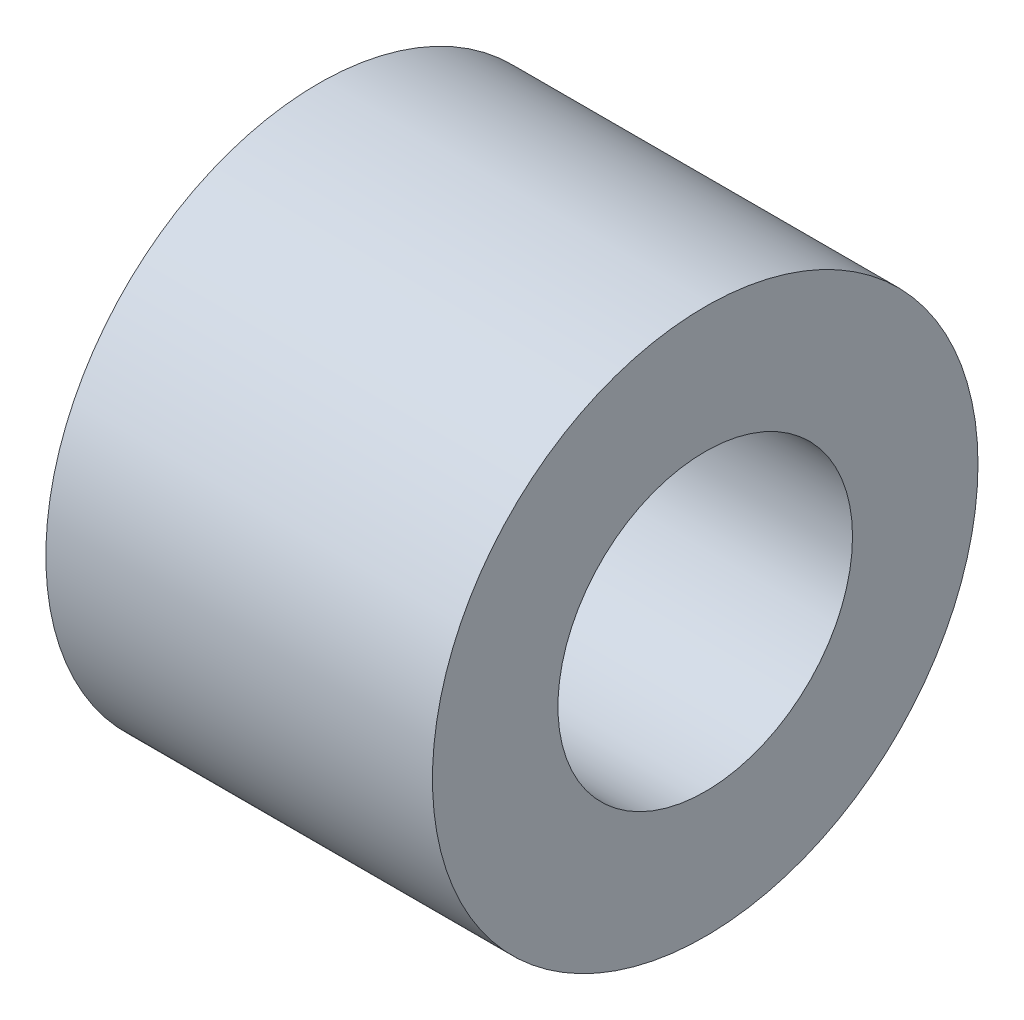
ISO-10303-21;
HEADER;
FILE_DESCRIPTION(('STEP AP214'),'2;1');
FILE_NAME('part.step','',(''),(''),'','','');
FILE_SCHEMA(('AUTOMOTIVE_DESIGN { 1 0 10303 214 1 1 1 1 }'));
ENDSEC;
DATA;
#1=APPLICATION_CONTEXT('core data for automotive mechanical design processes');
#2=APPLICATION_PROTOCOL_DEFINITION('international standard','automotive_design',2000,#1);
#3=PRODUCT_CONTEXT('',#1,'mechanical');
#4=PRODUCT('Part','Part','',(#3));
#5=PRODUCT_RELATED_PRODUCT_CATEGORY('part','',(#4));
#6=PRODUCT_DEFINITION_FORMATION('','',#4);
#7=PRODUCT_DEFINITION_CONTEXT('part definition',#1,'design');
#8=PRODUCT_DEFINITION('design','',#6,#7);
#9=PRODUCT_DEFINITION_SHAPE('','',#8);
#10=(LENGTH_UNIT() NAMED_UNIT(*) SI_UNIT(.MILLI.,.METRE.));
#11=(NAMED_UNIT(*) PLANE_ANGLE_UNIT() SI_UNIT($,.RADIAN.));
#12=(NAMED_UNIT(*) SI_UNIT($,.STERADIAN.) SOLID_ANGLE_UNIT());
#13=UNCERTAINTY_MEASURE_WITH_UNIT(LENGTH_MEASURE(1.E-05),#10,'distance_accuracy_value','');
#14=(GEOMETRIC_REPRESENTATION_CONTEXT(3) GLOBAL_UNCERTAINTY_ASSIGNED_CONTEXT((#13)) GLOBAL_UNIT_ASSIGNED_CONTEXT((#10,
#11,#12)) REPRESENTATION_CONTEXT('',''));
#15=CARTESIAN_POINT('',(0.,0.,0.));
#16=DIRECTION('',(0.,0.,1.));
#17=DIRECTION('',(1.,0.,0.));
#18=AXIS2_PLACEMENT_3D('',#15,#16,#17);
#19=CARTESIAN_POINT('',(-9.,0.,0.));
#20=DIRECTION('',(1.,0.,0.));
#21=DIRECTION('',(0.,0.,-1.));
#22=AXIS2_PLACEMENT_3D('',#19,#20,#21);
#23=CYLINDRICAL_SURFACE('',#22,6.35);
#24=CARTESIAN_POINT('',(-9.,0.,0.));
#25=DIRECTION('',(1.,0.,0.));
#26=DIRECTION('',(0.,0.,-1.));
#27=AXIS2_PLACEMENT_3D('',#24,#25,#26);
#28=CIRCLE('',#27,6.35);
#29=CARTESIAN_POINT('',(-9.,0.,-6.35));
#30=VERTEX_POINT('',#29);
#31=EDGE_CURVE('E10',#30,#30,#28,.T.);
#32=ORIENTED_EDGE('',*,*,#31,.T.);
#33=EDGE_LOOP('',(#32));
#34=FACE_BOUND('',#33,.T.);
#35=CARTESIAN_POINT('',(0.,0.,0.));
#36=DIRECTION('',(1.,0.,0.));
#37=DIRECTION('',(0.,0.,-1.));
#38=AXIS2_PLACEMENT_3D('',#35,#36,#37);
#39=CIRCLE('',#38,6.35);
#40=CARTESIAN_POINT('',(0.,0.,-6.35));
#41=VERTEX_POINT('',#40);
#42=EDGE_CURVE('E34',#41,#41,#39,.T.);
#43=ORIENTED_EDGE('',*,*,#42,.F.);
#44=EDGE_LOOP('',(#43));
#45=FACE_BOUND('',#44,.T.);
#46=ADVANCED_FACE('F31',(#34,#45),#23,.T.);
#47=CARTESIAN_POINT('',(-9.,0.,0.));
#48=DIRECTION('',(1.,0.,0.));
#49=DIRECTION('',(0.,0.,-1.));
#50=AXIS2_PLACEMENT_3D('',#47,#48,#49);
#51=PLANE('',#50);
#52=CARTESIAN_POINT('',(-9.,0.,0.));
#53=DIRECTION('',(1.,0.,0.));
#54=DIRECTION('',(0.,0.,-1.));
#55=AXIS2_PLACEMENT_3D('',#52,#53,#54);
#56=CIRCLE('',#55,3.429);
#57=CARTESIAN_POINT('',(-9.,0.,-3.429));
#58=VERTEX_POINT('',#57);
#59=EDGE_CURVE('E41',#58,#58,#56,.T.);
#60=ORIENTED_EDGE('',*,*,#59,.T.);
#61=EDGE_LOOP('',(#60));
#62=FACE_BOUND('',#61,.T.);
#63=ORIENTED_EDGE('',*,*,#31,.F.);
#64=EDGE_LOOP('',(#63));
#65=FACE_BOUND('',#64,.T.);
#66=ADVANCED_FACE('F49',(#62,#65),#51,.F.);
#67=CARTESIAN_POINT('',(0.,0.,0.));
#68=DIRECTION('',(1.,0.,0.));
#69=DIRECTION('',(0.,0.,-1.));
#70=AXIS2_PLACEMENT_3D('',#67,#68,#69);
#71=PLANE('',#70);
#72=CARTESIAN_POINT('',(0.,0.,0.));
#73=DIRECTION('',(1.,0.,0.));
#74=DIRECTION('',(0.,0.,-1.));
#75=AXIS2_PLACEMENT_3D('',#72,#73,#74);
#76=CIRCLE('',#75,3.429);
#77=CARTESIAN_POINT('',(0.,0.,-3.429));
#78=VERTEX_POINT('',#77);
#79=EDGE_CURVE('E43',#78,#78,#76,.T.);
#80=ORIENTED_EDGE('',*,*,#79,.F.);
#81=EDGE_LOOP('',(#80));
#82=FACE_BOUND('',#81,.T.);
#83=ORIENTED_EDGE('',*,*,#42,.T.);
#84=EDGE_LOOP('',(#83));
#85=FACE_BOUND('',#84,.T.);
#86=ADVANCED_FACE('F55',(#82,#85),#71,.T.);
#87=CARTESIAN_POINT('',(-9.,0.,0.));
#88=DIRECTION('',(1.,0.,0.));
#89=DIRECTION('',(0.,0.,-1.));
#90=AXIS2_PLACEMENT_3D('',#87,#88,#89);
#91=CYLINDRICAL_SURFACE('',#90,3.429);
#92=ORIENTED_EDGE('',*,*,#59,.F.);
#93=EDGE_LOOP('',(#92));
#94=FACE_BOUND('',#93,.T.);
#95=ORIENTED_EDGE('',*,*,#79,.T.);
#96=EDGE_LOOP('',(#95));
#97=FACE_BOUND('',#96,.T.);
#98=ADVANCED_FACE('F52',(#94,#97),#91,.F.);
#99=CLOSED_SHELL('',(#46,#66,#86,#98));
#100=MANIFOLD_SOLID_BREP('B2',#99);
#101=ADVANCED_BREP_SHAPE_REPRESENTATION('',(#18,#100),#14);
#102=SHAPE_DEFINITION_REPRESENTATION(#9,#101);
ENDSEC;
END-ISO-10303-21;
